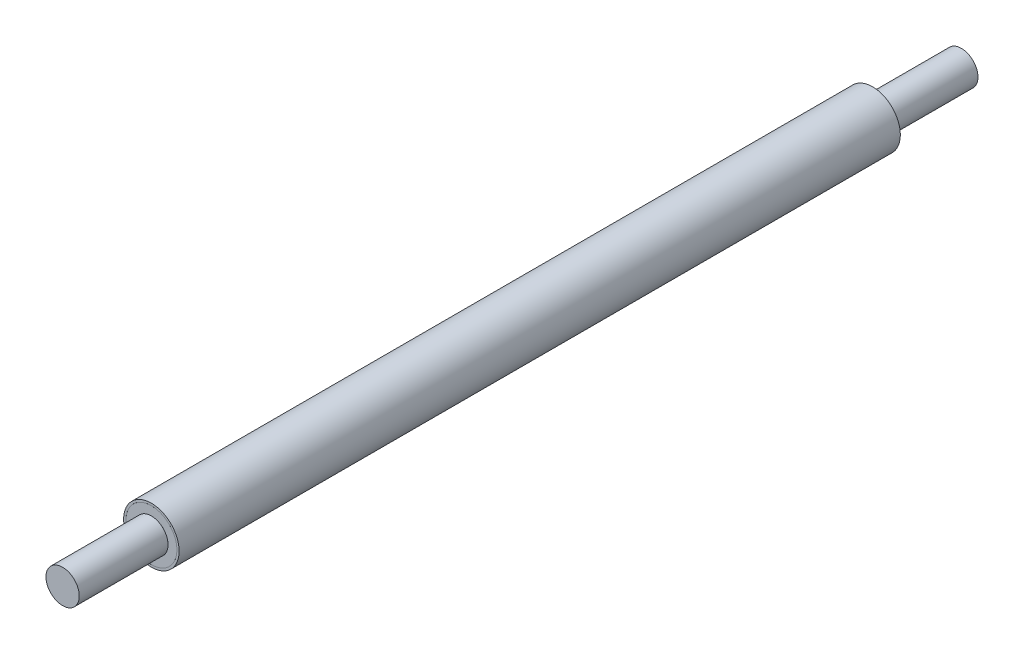
ISO-10303-21;
HEADER;
FILE_DESCRIPTION(('STEP AP214'),'2;1');
FILE_NAME('part.step','',(''),(''),'','','');
FILE_SCHEMA(('AUTOMOTIVE_DESIGN { 1 0 10303 214 1 1 1 1 }'));
ENDSEC;
DATA;
#1=APPLICATION_CONTEXT('core data for automotive mechanical design processes');
#2=APPLICATION_PROTOCOL_DEFINITION('international standard','automotive_design',2000,#1);
#3=PRODUCT_CONTEXT('',#1,'mechanical');
#4=PRODUCT('Part','Part','',(#3));
#5=PRODUCT_RELATED_PRODUCT_CATEGORY('part','',(#4));
#6=PRODUCT_DEFINITION_FORMATION('','',#4);
#7=PRODUCT_DEFINITION_CONTEXT('part definition',#1,'design');
#8=PRODUCT_DEFINITION('design','',#6,#7);
#9=PRODUCT_DEFINITION_SHAPE('','',#8);
#10=(LENGTH_UNIT() NAMED_UNIT(*) SI_UNIT(.MILLI.,.METRE.));
#11=(NAMED_UNIT(*) PLANE_ANGLE_UNIT() SI_UNIT($,.RADIAN.));
#12=(NAMED_UNIT(*) SI_UNIT($,.STERADIAN.) SOLID_ANGLE_UNIT());
#13=UNCERTAINTY_MEASURE_WITH_UNIT(LENGTH_MEASURE(1.E-05),#10,'distance_accuracy_value','');
#14=(GEOMETRIC_REPRESENTATION_CONTEXT(3) GLOBAL_UNCERTAINTY_ASSIGNED_CONTEXT((#13)) GLOBAL_UNIT_ASSIGNED_CONTEXT((#10,
#11,#12)) REPRESENTATION_CONTEXT('',''));
#15=CARTESIAN_POINT('',(0.,0.,0.));
#16=DIRECTION('',(0.,0.,1.));
#17=DIRECTION('',(1.,0.,0.));
#18=AXIS2_PLACEMENT_3D('',#15,#16,#17);
#19=CARTESIAN_POINT('',(0.,0.,315.));
#20=DIRECTION('',(0.,0.,1.));
#21=DIRECTION('',(-1.,0.,0.));
#22=AXIS2_PLACEMENT_3D('',#19,#20,#21);
#23=CYLINDRICAL_SURFACE('',#22,23.);
#24=CARTESIAN_POINT('',(0.,0.,315.));
#25=DIRECTION('',(0.,0.,-1.));
#26=DIRECTION('',(-1.,0.,0.));
#27=AXIS2_PLACEMENT_3D('',#24,#25,#26);
#28=CIRCLE('',#27,23.);
#29=CARTESIAN_POINT('',(-23.,0.,315.));
#30=VERTEX_POINT('',#29);
#31=EDGE_CURVE('E11',#30,#30,#28,.T.);
#32=ORIENTED_EDGE('',*,*,#31,.F.);
#33=EDGE_LOOP('',(#32));
#34=FACE_BOUND('',#33,.T.);
#35=CARTESIAN_POINT('',(0.,0.,325.));
#36=DIRECTION('',(0.,0.,-1.));
#37=DIRECTION('',(-1.,0.,0.));
#38=AXIS2_PLACEMENT_3D('',#35,#36,#37);
#39=CIRCLE('',#38,23.);
#40=CARTESIAN_POINT('',(-23.,0.,325.));
#41=VERTEX_POINT('',#40);
#42=EDGE_CURVE('E47',#41,#41,#39,.T.);
#43=ORIENTED_EDGE('',*,*,#42,.T.);
#44=EDGE_LOOP('',(#43));
#45=FACE_BOUND('',#44,.T.);
#46=ADVANCED_FACE('F44',(#34,#45),#23,.T.);
#47=CARTESIAN_POINT('',(0.,0.,315.));
#48=DIRECTION('',(0.,0.,1.));
#49=DIRECTION('',(-1.,0.,0.));
#50=AXIS2_PLACEMENT_3D('',#47,#48,#49);
#51=PLANE('',#50);
#52=CARTESIAN_POINT('',(0.,0.,315.));
#53=DIRECTION('',(0.,0.,-1.));
#54=DIRECTION('',(-1.,0.,0.));
#55=AXIS2_PLACEMENT_3D('',#52,#53,#54);
#56=CIRCLE('',#55,15.);
#57=CARTESIAN_POINT('',(-15.,0.,315.));
#58=VERTEX_POINT('',#57);
#59=EDGE_CURVE('E54',#58,#58,#56,.T.);
#60=ORIENTED_EDGE('',*,*,#59,.F.);
#61=EDGE_LOOP('',(#60));
#62=FACE_BOUND('',#61,.T.);
#63=ORIENTED_EDGE('',*,*,#31,.T.);
#64=EDGE_LOOP('',(#63));
#65=FACE_BOUND('',#64,.T.);
#66=ADVANCED_FACE('F65',(#62,#65),#51,.F.);
#67=CARTESIAN_POINT('',(0.,0.,325.));
#68=DIRECTION('',(0.,0.,1.));
#69=DIRECTION('',(-1.,0.,0.));
#70=AXIS2_PLACEMENT_3D('',#67,#68,#69);
#71=PLANE('',#70);
#72=CARTESIAN_POINT('',(0.,0.,325.));
#73=DIRECTION('',(0.,0.,-1.));
#74=DIRECTION('',(-1.,0.,0.));
#75=AXIS2_PLACEMENT_3D('',#72,#73,#74);
#76=CIRCLE('',#75,15.);
#77=CARTESIAN_POINT('',(-15.,0.,325.));
#78=VERTEX_POINT('',#77);
#79=EDGE_CURVE('E56',#78,#78,#76,.T.);
#80=ORIENTED_EDGE('',*,*,#79,.T.);
#81=EDGE_LOOP('',(#80));
#82=FACE_BOUND('',#81,.T.);
#83=ORIENTED_EDGE('',*,*,#42,.F.);
#84=EDGE_LOOP('',(#83));
#85=FACE_BOUND('',#84,.T.);
#86=ADVANCED_FACE('F67',(#82,#85),#71,.T.);
#87=CARTESIAN_POINT('',(0.,0.,315.));
#88=DIRECTION('',(0.,0.,1.));
#89=DIRECTION('',(-1.,0.,0.));
#90=AXIS2_PLACEMENT_3D('',#87,#88,#89);
#91=CYLINDRICAL_SURFACE('',#90,15.);
#92=ORIENTED_EDGE('',*,*,#59,.T.);
#93=EDGE_LOOP('',(#92));
#94=FACE_BOUND('',#93,.T.);
#95=ORIENTED_EDGE('',*,*,#79,.F.);
#96=EDGE_LOOP('',(#95));
#97=FACE_BOUND('',#96,.T.);
#98=ADVANCED_FACE('F62',(#94,#97),#91,.F.);
#99=CLOSED_SHELL('',(#46,#66,#86,#98));
#100=MANIFOLD_SOLID_BREP('B2',#99);
#101=CARTESIAN_POINT('',(0.,0.,-315.));
#102=DIRECTION('',(0.,0.,-1.));
#103=DIRECTION('',(-1.,0.,0.));
#104=AXIS2_PLACEMENT_3D('',#101,#102,#103);
#105=CYLINDRICAL_SURFACE('',#104,23.);
#106=CARTESIAN_POINT('',(0.,0.,-315.));
#107=DIRECTION('',(0.,0.,-1.));
#108=DIRECTION('',(-1.,0.,0.));
#109=AXIS2_PLACEMENT_3D('',#106,#107,#108);
#110=CIRCLE('',#109,23.);
#111=CARTESIAN_POINT('',(-23.,0.,-315.));
#112=VERTEX_POINT('',#111);
#113=EDGE_CURVE('E43',#112,#112,#110,.T.);
#114=ORIENTED_EDGE('',*,*,#113,.T.);
#115=EDGE_LOOP('',(#114));
#116=FACE_BOUND('',#115,.T.);
#117=CARTESIAN_POINT('',(0.,0.,-325.));
#118=DIRECTION('',(0.,0.,-1.));
#119=DIRECTION('',(-1.,0.,0.));
#120=AXIS2_PLACEMENT_3D('',#117,#118,#119);
#121=CIRCLE('',#120,23.);
#122=CARTESIAN_POINT('',(-23.,0.,-325.));
#123=VERTEX_POINT('',#122);
#124=EDGE_CURVE('E117',#123,#123,#121,.T.);
#125=ORIENTED_EDGE('',*,*,#124,.F.);
#126=EDGE_LOOP('',(#125));
#127=FACE_BOUND('',#126,.T.);
#128=ADVANCED_FACE('F114',(#116,#127),#105,.T.);
#129=CARTESIAN_POINT('',(0.,0.,-315.));
#130=DIRECTION('',(0.,0.,-1.));
#131=DIRECTION('',(-1.,0.,0.));
#132=AXIS2_PLACEMENT_3D('',#129,#130,#131);
#133=PLANE('',#132);
#134=CARTESIAN_POINT('',(0.,0.,-315.));
#135=DIRECTION('',(0.,0.,-1.));
#136=DIRECTION('',(-1.,0.,0.));
#137=AXIS2_PLACEMENT_3D('',#134,#135,#136);
#138=CIRCLE('',#137,15.);
#139=CARTESIAN_POINT('',(-15.,0.,-315.));
#140=VERTEX_POINT('',#139);
#141=EDGE_CURVE('E124',#140,#140,#138,.T.);
#142=ORIENTED_EDGE('',*,*,#141,.T.);
#143=EDGE_LOOP('',(#142));
#144=FACE_BOUND('',#143,.T.);
#145=ORIENTED_EDGE('',*,*,#113,.F.);
#146=EDGE_LOOP('',(#145));
#147=FACE_BOUND('',#146,.T.);
#148=ADVANCED_FACE('F132',(#144,#147),#133,.F.);
#149=CARTESIAN_POINT('',(0.,0.,-325.));
#150=DIRECTION('',(0.,0.,-1.));
#151=DIRECTION('',(-1.,0.,0.));
#152=AXIS2_PLACEMENT_3D('',#149,#150,#151);
#153=PLANE('',#152);
#154=CARTESIAN_POINT('',(0.,0.,-325.));
#155=DIRECTION('',(0.,0.,-1.));
#156=DIRECTION('',(-1.,0.,0.));
#157=AXIS2_PLACEMENT_3D('',#154,#155,#156);
#158=CIRCLE('',#157,15.);
#159=CARTESIAN_POINT('',(-15.,0.,-325.));
#160=VERTEX_POINT('',#159);
#161=EDGE_CURVE('E126',#160,#160,#158,.T.);
#162=ORIENTED_EDGE('',*,*,#161,.F.);
#163=EDGE_LOOP('',(#162));
#164=FACE_BOUND('',#163,.T.);
#165=ORIENTED_EDGE('',*,*,#124,.T.);
#166=EDGE_LOOP('',(#165));
#167=FACE_BOUND('',#166,.T.);
#168=ADVANCED_FACE('F138',(#164,#167),#153,.T.);
#169=CARTESIAN_POINT('',(0.,0.,-315.));
#170=DIRECTION('',(0.,0.,-1.));
#171=DIRECTION('',(-1.,0.,0.));
#172=AXIS2_PLACEMENT_3D('',#169,#170,#171);
#173=CYLINDRICAL_SURFACE('',#172,15.);
#174=ORIENTED_EDGE('',*,*,#141,.F.);
#175=EDGE_LOOP('',(#174));
#176=FACE_BOUND('',#175,.T.);
#177=ORIENTED_EDGE('',*,*,#161,.T.);
#178=EDGE_LOOP('',(#177));
#179=FACE_BOUND('',#178,.T.);
#180=ADVANCED_FACE('F135',(#176,#179),#173,.F.);
#181=CLOSED_SHELL('',(#128,#148,#168,#180));
#182=MANIFOLD_SOLID_BREP('B6',#181);
#183=CARTESIAN_POINT('',(0.,0.,-405.));
#184=DIRECTION('',(0.,0.,1.));
#185=DIRECTION('',(-1.,0.,0.));
#186=AXIS2_PLACEMENT_3D('',#183,#184,#185);
#187=CYLINDRICAL_SURFACE('',#186,15.);
#188=CARTESIAN_POINT('',(0.,0.,-405.));
#189=DIRECTION('',(0.,0.,1.));
#190=DIRECTION('',(1.,0.,0.));
#191=AXIS2_PLACEMENT_3D('',#188,#189,#190);
#192=CIRCLE('',#191,15.);
#193=CARTESIAN_POINT('',(15.,0.,-405.));
#194=VERTEX_POINT('',#193);
#195=EDGE_CURVE('E113',#194,#194,#192,.T.);
#196=ORIENTED_EDGE('',*,*,#195,.T.);
#197=EDGE_LOOP('',(#196));
#198=FACE_BOUND('',#197,.T.);
#199=CARTESIAN_POINT('',(0.,0.,-325.));
#200=DIRECTION('',(0.,0.,1.));
#201=DIRECTION('',(1.,0.,0.));
#202=AXIS2_PLACEMENT_3D('',#199,#200,#201);
#203=CIRCLE('',#202,15.);
#204=CARTESIAN_POINT('',(15.,0.,-325.));
#205=VERTEX_POINT('',#204);
#206=EDGE_CURVE('E187',#205,#205,#203,.T.);
#207=ORIENTED_EDGE('',*,*,#206,.F.);
#208=EDGE_LOOP('',(#207));
#209=FACE_BOUND('',#208,.T.);
#210=ADVANCED_FACE('F184',(#198,#209),#187,.T.);
#211=CARTESIAN_POINT('',(0.,0.,-405.));
#212=DIRECTION('',(0.,0.,-1.));
#213=DIRECTION('',(1.,0.,0.));
#214=AXIS2_PLACEMENT_3D('',#211,#212,#213);
#215=PLANE('',#214);
#216=ORIENTED_EDGE('',*,*,#195,.F.);
#217=EDGE_LOOP('',(#216));
#218=FACE_BOUND('',#217,.T.);
#219=ADVANCED_FACE('F199',(#218),#215,.T.);
#220=CARTESIAN_POINT('',(0.,0.,-325.));
#221=DIRECTION('',(0.,0.,-1.));
#222=DIRECTION('',(1.,0.,0.));
#223=AXIS2_PLACEMENT_3D('',#220,#221,#222);
#224=PLANE('',#223);
#225=ORIENTED_EDGE('',*,*,#206,.T.);
#226=EDGE_LOOP('',(#225));
#227=FACE_BOUND('',#226,.T.);
#228=ADVANCED_FACE('F196',(#227),#224,.F.);
#229=CLOSED_SHELL('',(#210,#219,#228));
#230=MANIFOLD_SOLID_BREP('B38',#229);
#231=CARTESIAN_POINT('',(0.,0.,405.));
#232=DIRECTION('',(0.,0.,-1.));
#233=DIRECTION('',(-1.,0.,0.));
#234=AXIS2_PLACEMENT_3D('',#231,#232,#233);
#235=CYLINDRICAL_SURFACE('',#234,15.);
#236=CARTESIAN_POINT('',(0.,0.,405.));
#237=DIRECTION('',(0.,0.,1.));
#238=DIRECTION('',(1.,0.,0.));
#239=AXIS2_PLACEMENT_3D('',#236,#237,#238);
#240=CIRCLE('',#239,15.);
#241=CARTESIAN_POINT('',(15.,0.,405.));
#242=VERTEX_POINT('',#241);
#243=EDGE_CURVE('E183',#242,#242,#240,.T.);
#244=ORIENTED_EDGE('',*,*,#243,.F.);
#245=EDGE_LOOP('',(#244));
#246=FACE_BOUND('',#245,.T.);
#247=CARTESIAN_POINT('',(0.,0.,325.));
#248=DIRECTION('',(0.,0.,1.));
#249=DIRECTION('',(1.,0.,0.));
#250=AXIS2_PLACEMENT_3D('',#247,#248,#249);
#251=CIRCLE('',#250,15.);
#252=CARTESIAN_POINT('',(15.,0.,325.));
#253=VERTEX_POINT('',#252);
#254=EDGE_CURVE('E235',#253,#253,#251,.T.);
#255=ORIENTED_EDGE('',*,*,#254,.T.);
#256=EDGE_LOOP('',(#255));
#257=FACE_BOUND('',#256,.T.);
#258=ADVANCED_FACE('F232',(#246,#257),#235,.T.);
#259=CARTESIAN_POINT('',(0.,0.,405.));
#260=DIRECTION('',(0.,0.,1.));
#261=DIRECTION('',(1.,0.,0.));
#262=AXIS2_PLACEMENT_3D('',#259,#260,#261);
#263=PLANE('',#262);
#264=ORIENTED_EDGE('',*,*,#243,.T.);
#265=EDGE_LOOP('',(#264));
#266=FACE_BOUND('',#265,.T.);
#267=ADVANCED_FACE('F247',(#266),#263,.T.);
#268=CARTESIAN_POINT('',(0.,0.,325.));
#269=DIRECTION('',(0.,0.,1.));
#270=DIRECTION('',(1.,0.,0.));
#271=AXIS2_PLACEMENT_3D('',#268,#269,#270);
#272=PLANE('',#271);
#273=ORIENTED_EDGE('',*,*,#254,.F.);
#274=EDGE_LOOP('',(#273));
#275=FACE_BOUND('',#274,.T.);
#276=ADVANCED_FACE('F245',(#275),#272,.F.);
#277=CLOSED_SHELL('',(#258,#267,#276));
#278=MANIFOLD_SOLID_BREP('B108',#277);
#279=CARTESIAN_POINT('',(0.,0.,325.));
#280=DIRECTION('',(0.,0.,-1.));
#281=DIRECTION('',(-1.,0.,0.));
#282=AXIS2_PLACEMENT_3D('',#279,#280,#281);
#283=CYLINDRICAL_SURFACE('',#282,25.);
#284=CARTESIAN_POINT('',(0.,0.,325.));
#285=DIRECTION('',(0.,0.,1.));
#286=DIRECTION('',(1.,0.,0.));
#287=AXIS2_PLACEMENT_3D('',#284,#285,#286);
#288=CIRCLE('',#287,25.);
#289=CARTESIAN_POINT('',(25.,0.,325.));
#290=VERTEX_POINT('',#289);
#291=EDGE_CURVE('E231',#290,#290,#288,.T.);
#292=ORIENTED_EDGE('',*,*,#291,.F.);
#293=EDGE_LOOP('',(#292));
#294=FACE_BOUND('',#293,.T.);
#295=CARTESIAN_POINT('',(0.,0.,-325.));
#296=DIRECTION('',(0.,0.,1.));
#297=DIRECTION('',(1.,0.,0.));
#298=AXIS2_PLACEMENT_3D('',#295,#296,#297);
#299=CIRCLE('',#298,25.);
#300=CARTESIAN_POINT('',(25.,0.,-325.));
#301=VERTEX_POINT('',#300);
#302=EDGE_CURVE('E276',#301,#301,#299,.T.);
#303=ORIENTED_EDGE('',*,*,#302,.T.);
#304=EDGE_LOOP('',(#303));
#305=FACE_BOUND('',#304,.T.);
#306=ADVANCED_FACE('F273',(#294,#305),#283,.T.);
#307=CARTESIAN_POINT('',(0.,0.,325.));
#308=DIRECTION('',(0.,0.,1.));
#309=DIRECTION('',(1.,0.,0.));
#310=AXIS2_PLACEMENT_3D('',#307,#308,#309);
#311=PLANE('',#310);
#312=CARTESIAN_POINT('',(0.,0.,325.));
#313=DIRECTION('',(0.,0.,1.));
#314=DIRECTION('',(1.,0.,0.));
#315=AXIS2_PLACEMENT_3D('',#312,#313,#314);
#316=CIRCLE('',#315,23.);
#317=CARTESIAN_POINT('',(23.,0.,325.));
#318=VERTEX_POINT('',#317);
#319=EDGE_CURVE('E283',#318,#318,#316,.T.);
#320=ORIENTED_EDGE('',*,*,#319,.F.);
#321=EDGE_LOOP('',(#320));
#322=FACE_BOUND('',#321,.T.);
#323=ORIENTED_EDGE('',*,*,#291,.T.);
#324=EDGE_LOOP('',(#323));
#325=FACE_BOUND('',#324,.T.);
#326=ADVANCED_FACE('F294',(#322,#325),#311,.T.);
#327=CARTESIAN_POINT('',(0.,0.,-325.));
#328=DIRECTION('',(0.,0.,1.));
#329=DIRECTION('',(1.,0.,0.));
#330=AXIS2_PLACEMENT_3D('',#327,#328,#329);
#331=PLANE('',#330);
#332=CARTESIAN_POINT('',(0.,0.,-325.));
#333=DIRECTION('',(0.,0.,1.));
#334=DIRECTION('',(1.,0.,0.));
#335=AXIS2_PLACEMENT_3D('',#332,#333,#334);
#336=CIRCLE('',#335,23.);
#337=CARTESIAN_POINT('',(23.,0.,-325.));
#338=VERTEX_POINT('',#337);
#339=EDGE_CURVE('E285',#338,#338,#336,.T.);
#340=ORIENTED_EDGE('',*,*,#339,.T.);
#341=EDGE_LOOP('',(#340));
#342=FACE_BOUND('',#341,.T.);
#343=ORIENTED_EDGE('',*,*,#302,.F.);
#344=EDGE_LOOP('',(#343));
#345=FACE_BOUND('',#344,.T.);
#346=ADVANCED_FACE('F296',(#342,#345),#331,.F.);
#347=CARTESIAN_POINT('',(0.,0.,325.));
#348=DIRECTION('',(0.,0.,-1.));
#349=DIRECTION('',(-1.,0.,0.));
#350=AXIS2_PLACEMENT_3D('',#347,#348,#349);
#351=CYLINDRICAL_SURFACE('',#350,23.);
#352=ORIENTED_EDGE('',*,*,#319,.T.);
#353=EDGE_LOOP('',(#352));
#354=FACE_BOUND('',#353,.T.);
#355=ORIENTED_EDGE('',*,*,#339,.F.);
#356=EDGE_LOOP('',(#355));
#357=FACE_BOUND('',#356,.T.);
#358=ADVANCED_FACE('F291',(#354,#357),#351,.F.);
#359=CLOSED_SHELL('',(#306,#326,#346,#358));
#360=MANIFOLD_SOLID_BREP('B178',#359);
#361=ADVANCED_BREP_SHAPE_REPRESENTATION('',(#18,#100,#182,#230,#278,#360),#14);
#362=SHAPE_DEFINITION_REPRESENTATION(#9,#361);
ENDSEC;
END-ISO-10303-21;
